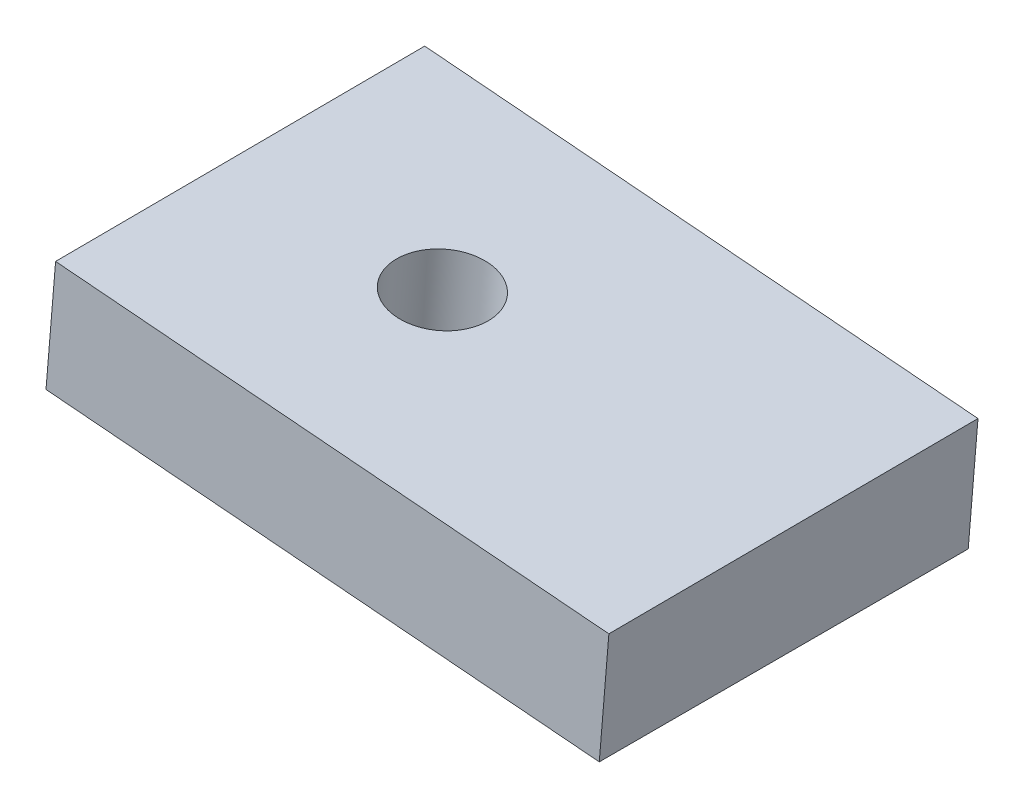
ISO-10303-21;
HEADER;
FILE_DESCRIPTION(('STEP AP214'),'2;1');
FILE_NAME('part.step','',(''),(''),'','','');
FILE_SCHEMA(('AUTOMOTIVE_DESIGN { 1 0 10303 214 1 1 1 1 }'));
ENDSEC;
DATA;
#1=APPLICATION_CONTEXT('core data for automotive mechanical design processes');
#2=APPLICATION_PROTOCOL_DEFINITION('international standard','automotive_design',2000,#1);
#3=PRODUCT_CONTEXT('',#1,'mechanical');
#4=PRODUCT('Part','Part','',(#3));
#5=PRODUCT_RELATED_PRODUCT_CATEGORY('part','',(#4));
#6=PRODUCT_DEFINITION_FORMATION('','',#4);
#7=PRODUCT_DEFINITION_CONTEXT('part definition',#1,'design');
#8=PRODUCT_DEFINITION('design','',#6,#7);
#9=PRODUCT_DEFINITION_SHAPE('','',#8);
#10=(LENGTH_UNIT() NAMED_UNIT(*) SI_UNIT(.MILLI.,.METRE.));
#11=(NAMED_UNIT(*) PLANE_ANGLE_UNIT() SI_UNIT($,.RADIAN.));
#12=(NAMED_UNIT(*) SI_UNIT($,.STERADIAN.) SOLID_ANGLE_UNIT());
#13=UNCERTAINTY_MEASURE_WITH_UNIT(LENGTH_MEASURE(1.E-05),#10,'distance_accuracy_value','');
#14=(GEOMETRIC_REPRESENTATION_CONTEXT(3) GLOBAL_UNCERTAINTY_ASSIGNED_CONTEXT((#13)) GLOBAL_UNIT_ASSIGNED_CONTEXT((#10,
#11,#12)) REPRESENTATION_CONTEXT('',''));
#15=CARTESIAN_POINT('',(0.,0.,0.));
#16=DIRECTION('',(0.,0.,1.));
#17=DIRECTION('',(1.,0.,0.));
#18=AXIS2_PLACEMENT_3D('',#15,#16,#17);
#19=CARTESIAN_POINT('',(-25.1929971261734,-10.6671746696272,0.));
#20=DIRECTION('',(0.,0.,-1.));
#21=DIRECTION('',(-1.,0.,0.));
#22=AXIS2_PLACEMENT_3D('',#19,#20,#21);
#23=PLANE('',#22);
#24=DIRECTION('',(0.996579319521684,-0.0826417564049658,0.));
#25=VECTOR('',#24,1.);
#26=CARTESIAN_POINT('',(-25.4577662493894,-13.8600331484804,0.));
#27=LINE('',#26,#25);
#28=CARTESIAN_POINT('',(-25.4577662493894,-13.8600331484804,0.));
#29=VERTEX_POINT('',#28);
#30=CARTESIAN_POINT('',(-10.4616682072446,-15.1035908434351,0.));
#31=VERTEX_POINT('',#30);
#32=EDGE_CURVE('E98',#29,#31,#27,.T.);
#33=ORIENTED_EDGE('',*,*,#32,.F.);
#34=DIRECTION('',(-0.0826417564049658,-0.996579319521684,0.));
#35=VECTOR('',#34,1.);
#36=CARTESIAN_POINT('',(-25.1929971261734,-10.6671746696272,0.));
#37=LINE('',#36,#35);
#38=CARTESIAN_POINT('',(-25.1929971261734,-10.6671746696272,0.));
#39=VERTEX_POINT('',#38);
#40=EDGE_CURVE('E11',#39,#29,#37,.T.);
#41=ORIENTED_EDGE('',*,*,#40,.F.);
#42=DIRECTION('',(0.996579319521684,-0.0826417564049658,0.));
#43=VECTOR('',#42,1.);
#44=CARTESIAN_POINT('',(-25.1929971261734,-10.6671746696272,0.));
#45=LINE('',#44,#43);
#46=CARTESIAN_POINT('',(-10.1968990840286,-11.9107323645819,0.));
#47=VERTEX_POINT('',#46);
#48=EDGE_CURVE('E86',#39,#47,#45,.T.);
#49=ORIENTED_EDGE('',*,*,#48,.T.);
#50=DIRECTION('',(-0.0826417564049658,-0.996579319521684,0.));
#51=VECTOR('',#50,1.);
#52=CARTESIAN_POINT('',(-10.1968990840286,-11.9107323645819,0.));
#53=LINE('',#52,#51);
#54=EDGE_CURVE('E75',#47,#31,#53,.T.);
#55=ORIENTED_EDGE('',*,*,#54,.T.);
#56=EDGE_LOOP('',(#33,#41,#49,#55));
#57=FACE_BOUND('',#56,.T.);
#58=ADVANCED_FACE('F32',(#57),#23,.T.);
#59=CARTESIAN_POINT('',(-25.1929971261734,-10.6671746696272,9.99999999999999));
#60=DIRECTION('',(-0.996579319521684,0.0826417564049658,0.));
#61=DIRECTION('',(-0.0826417564049658,-0.996579319521684,0.));
#62=AXIS2_PLACEMENT_3D('',#59,#60,#61);
#63=PLANE('',#62);
#64=DIRECTION('',(0.,0.,-1.));
#65=VECTOR('',#64,1.);
#66=CARTESIAN_POINT('',(-25.4577662493894,-13.8600331484804,9.99999999999999));
#67=LINE('',#66,#65);
#68=CARTESIAN_POINT('',(-25.4577662493894,-13.8600331484804,9.99999999999999));
#69=VERTEX_POINT('',#68);
#70=EDGE_CURVE('E90',#69,#29,#67,.T.);
#71=ORIENTED_EDGE('',*,*,#70,.F.);
#72=DIRECTION('',(-0.0826417564049658,-0.996579319521684,0.));
#73=VECTOR('',#72,1.);
#74=CARTESIAN_POINT('',(-25.1929971261734,-10.6671746696272,9.99999999999999));
#75=LINE('',#74,#73);
#76=CARTESIAN_POINT('',(-25.1976958972966,-10.7238372858667,9.99999999999999));
#77=VERTEX_POINT('',#76);
#78=EDGE_CURVE('E42',#77,#69,#75,.T.);
#79=ORIENTED_EDGE('',*,*,#78,.F.);
#80=DIRECTION('',(-0.000469869517572879,-0.00566617003869275,0.999983836739239));
#81=VECTOR('',#80,1.);
#82=CARTESIAN_POINT('',(-25.1929971261734,-10.6671746696272,0.));
#83=LINE('',#82,#81);
#84=EDGE_CURVE('E82',#77,#39,#83,.F.);
#85=ORIENTED_EDGE('',*,*,#84,.T.);
#86=ORIENTED_EDGE('',*,*,#40,.T.);
#87=EDGE_LOOP('',(#71,#79,#85,#86));
#88=FACE_BOUND('',#87,.T.);
#89=ADVANCED_FACE('F107',(#88),#63,.T.);
#90=CARTESIAN_POINT('',(-10.1968990840286,-11.9107323645819,10.));
#91=DIRECTION('',(0.,0.,1.));
#92=DIRECTION('',(1.,0.,0.));
#93=AXIS2_PLACEMENT_3D('',#90,#91,#92);
#94=PLANE('',#93);
#95=DIRECTION('',(-0.996579319521684,0.0826417564049658,0.));
#96=VECTOR('',#95,1.);
#97=CARTESIAN_POINT('',(-10.4616682072446,-15.1035908434351,10.));
#98=LINE('',#97,#96);
#99=CARTESIAN_POINT('',(-10.4616682072446,-15.1035908434351,10.));
#100=VERTEX_POINT('',#99);
#101=EDGE_CURVE('E93',#100,#69,#98,.T.);
#102=ORIENTED_EDGE('',*,*,#101,.F.);
#103=DIRECTION('',(-0.0826417564049658,-0.996579319521684,0.));
#104=VECTOR('',#103,1.);
#105=CARTESIAN_POINT('',(-10.1968990840286,-11.9107323645819,10.));
#106=LINE('',#105,#104);
#107=CARTESIAN_POINT('',(-10.2015978551518,-11.9673949808214,10.));
#108=VERTEX_POINT('',#107);
#109=EDGE_CURVE('E69',#108,#100,#106,.T.);
#110=ORIENTED_EDGE('',*,*,#109,.F.);
#111=DIRECTION('',(0.996579319521684,-0.0826417564049657,0.));
#112=VECTOR('',#111,1.);
#113=CARTESIAN_POINT('',(-25.1976958972966,-10.7238372858667,9.99999999999999));
#114=LINE('',#113,#112);
#115=EDGE_CURVE('E88',#108,#77,#114,.F.);
#116=ORIENTED_EDGE('',*,*,#115,.T.);
#117=ORIENTED_EDGE('',*,*,#78,.T.);
#118=EDGE_LOOP('',(#102,#110,#116,#117));
#119=FACE_BOUND('',#118,.T.);
#120=ADVANCED_FACE('F108',(#119),#94,.T.);
#121=CARTESIAN_POINT('',(-10.1968990840286,-11.9107323645819,0.));
#122=DIRECTION('',(0.996579319521684,-0.0826417564049658,0.));
#123=DIRECTION('',(0.0826417564049658,0.996579319521684,0.));
#124=AXIS2_PLACEMENT_3D('',#121,#122,#123);
#125=PLANE('',#124);
#126=DIRECTION('',(0.,0.,1.));
#127=VECTOR('',#126,1.);
#128=CARTESIAN_POINT('',(-10.4616682072446,-15.1035908434351,0.));
#129=LINE('',#128,#127);
#130=EDGE_CURVE('E80',#31,#100,#129,.T.);
#131=ORIENTED_EDGE('',*,*,#130,.F.);
#132=ORIENTED_EDGE('',*,*,#54,.F.);
#133=DIRECTION('',(0.000469869517573568,0.00566617003869269,-0.999983836739239));
#134=VECTOR('',#133,1.);
#135=CARTESIAN_POINT('',(-10.1968990840286,-11.9107323645819,0.));
#136=LINE('',#135,#134);
#137=EDGE_CURVE('E78',#47,#108,#136,.F.);
#138=ORIENTED_EDGE('',*,*,#137,.T.);
#139=ORIENTED_EDGE('',*,*,#109,.T.);
#140=EDGE_LOOP('',(#131,#132,#138,#139));
#141=FACE_BOUND('',#140,.T.);
#142=ADVANCED_FACE('F77',(#141),#125,.T.);
#143=CARTESIAN_POINT('',(-25.1929971261734,-10.6671746696272,0.));
#144=DIRECTION('',(0.0826404206447072,0.996563211550273,0.00568561872366795));
#145=DIRECTION('',(-0.996579319521684,0.0826417564049657,0.));
#146=AXIS2_PLACEMENT_3D('',#143,#144,#145);
#147=PLANE('',#146);
#148=CARTESIAN_POINT('',(-19.7141602543657,-11.1500356379743,5.));
#149=DIRECTION('',(0.0826404206447072,0.996563211550273,0.00568561872366795));
#150=DIRECTION('',(0.000469869517570446,0.00566617003869295,-0.999983836739239));
#151=AXIS2_PLACEMENT_3D('',#148,#149,#150);
#152=ELLIPSE('',#151,1.25002020440251,1.24999999999999);
#153=CARTESIAN_POINT('',(-19.7135729079753,-11.1429528109443,3.75000000000001));
#154=VERTEX_POINT('',#153);
#155=EDGE_CURVE('E97',#154,#154,#152,.F.);
#156=ORIENTED_EDGE('',*,*,#155,.T.);
#157=EDGE_LOOP('',(#156));
#158=FACE_BOUND('',#157,.T.);
#159=ORIENTED_EDGE('',*,*,#48,.F.);
#160=ORIENTED_EDGE('',*,*,#84,.F.);
#161=ORIENTED_EDGE('',*,*,#115,.F.);
#162=ORIENTED_EDGE('',*,*,#137,.F.);
#163=EDGE_LOOP('',(#159,#160,#161,#162));
#164=FACE_BOUND('',#163,.T.);
#165=ADVANCED_FACE('F34',(#158,#164),#147,.T.);
#166=CARTESIAN_POINT('',(-1.31536726133734,-15.8620516703576,0.));
#167=DIRECTION('',(-0.0826417564049658,-0.996579319521684,0.));
#168=DIRECTION('',(0.996579319521684,-0.0826417564049658,0.));
#169=AXIS2_PLACEMENT_3D('',#166,#167,#168);
#170=PLANE('',#169);
#171=CARTESIAN_POINT('',(-19.9765799920201,-14.3145628087078,5.));
#172=DIRECTION('',(-0.0826417564049658,-0.996579319521684,0.));
#173=DIRECTION('',(0.996579319521684,-0.0826417564049658,0.));
#174=AXIS2_PLACEMENT_3D('',#171,#172,#173);
#175=CIRCLE('',#174,1.24999999999999);
#176=CARTESIAN_POINT('',(-18.730855842618,-14.417865004214,5.));
#177=VERTEX_POINT('',#176);
#178=EDGE_CURVE('E36',#177,#177,#175,.T.);
#179=ORIENTED_EDGE('',*,*,#178,.F.);
#180=EDGE_LOOP('',(#179));
#181=FACE_BOUND('',#180,.T.);
#182=ORIENTED_EDGE('',*,*,#32,.T.);
#183=ORIENTED_EDGE('',*,*,#130,.T.);
#184=ORIENTED_EDGE('',*,*,#101,.T.);
#185=ORIENTED_EDGE('',*,*,#70,.T.);
#186=EDGE_LOOP('',(#182,#183,#184,#185));
#187=FACE_BOUND('',#186,.T.);
#188=ADVANCED_FACE('F143',(#181,#187),#170,.T.);
#189=CARTESIAN_POINT('',(-19.7135729079753,-11.1429528109442,5.));
#190=DIRECTION('',(0.0826417564049658,0.996579319521684,0.));
#191=DIRECTION('',(-0.996579319521684,0.0826417564049658,0.));
#192=AXIS2_PLACEMENT_3D('',#189,#190,#191);
#193=CYLINDRICAL_SURFACE('',#192,1.24999999999999);
#194=ORIENTED_EDGE('',*,*,#178,.T.);
#195=EDGE_LOOP('',(#194));
#196=FACE_BOUND('',#195,.T.);
#197=ORIENTED_EDGE('',*,*,#155,.F.);
#198=EDGE_LOOP('',(#197));
#199=FACE_BOUND('',#198,.T.);
#200=ADVANCED_FACE('F152',(#196,#199),#193,.F.);
#201=CLOSED_SHELL('',(#58,#89,#120,#142,#165,#188,#200));
#202=MANIFOLD_SOLID_BREP('B2',#201);
#203=ADVANCED_BREP_SHAPE_REPRESENTATION('',(#18,#202),#14);
#204=SHAPE_DEFINITION_REPRESENTATION(#9,#203);
ENDSEC;
END-ISO-10303-21;
